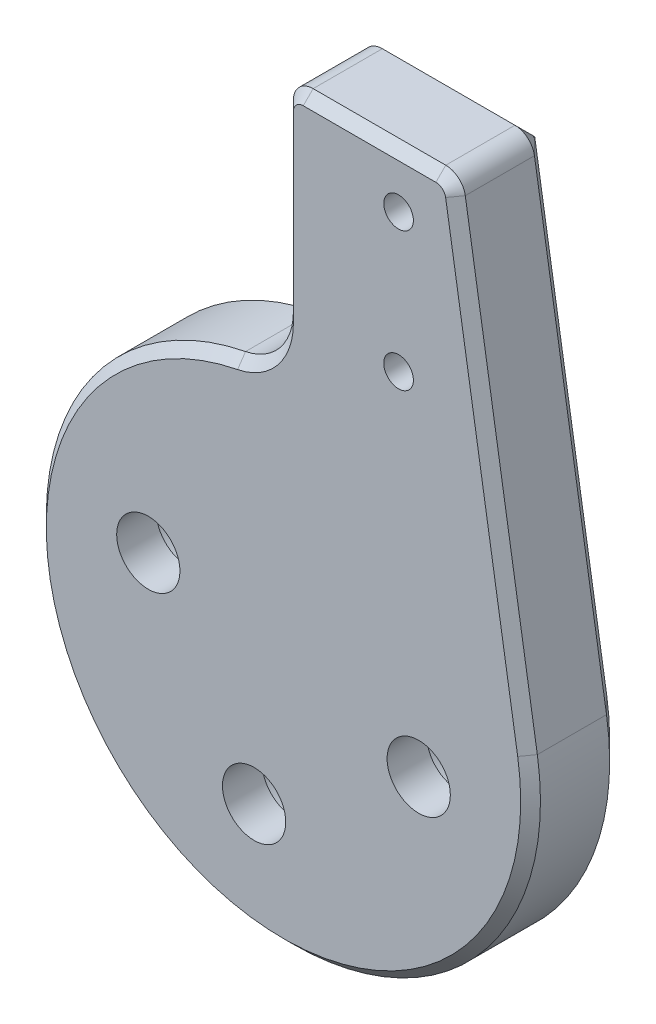
ISO-10303-21;
HEADER;
FILE_DESCRIPTION(('STEP AP214'),'2;1');
FILE_NAME('part.step','',(''),(''),'','','');
FILE_SCHEMA(('AUTOMOTIVE_DESIGN { 1 0 10303 214 1 1 1 1 }'));
ENDSEC;
DATA;
#1=APPLICATION_CONTEXT('core data for automotive mechanical design processes');
#2=APPLICATION_PROTOCOL_DEFINITION('international standard','automotive_design',2000,#1);
#3=PRODUCT_CONTEXT('',#1,'mechanical');
#4=PRODUCT('Part','Part','',(#3));
#5=PRODUCT_RELATED_PRODUCT_CATEGORY('part','',(#4));
#6=PRODUCT_DEFINITION_FORMATION('','',#4);
#7=PRODUCT_DEFINITION_CONTEXT('part definition',#1,'design');
#8=PRODUCT_DEFINITION('design','',#6,#7);
#9=PRODUCT_DEFINITION_SHAPE('','',#8);
#10=(LENGTH_UNIT() NAMED_UNIT(*) SI_UNIT(.MILLI.,.METRE.));
#11=(NAMED_UNIT(*) PLANE_ANGLE_UNIT() SI_UNIT($,.RADIAN.));
#12=(NAMED_UNIT(*) SI_UNIT($,.STERADIAN.) SOLID_ANGLE_UNIT());
#13=UNCERTAINTY_MEASURE_WITH_UNIT(LENGTH_MEASURE(1.E-05),#10,'distance_accuracy_value','');
#14=(GEOMETRIC_REPRESENTATION_CONTEXT(3) GLOBAL_UNCERTAINTY_ASSIGNED_CONTEXT((#13)) GLOBAL_UNIT_ASSIGNED_CONTEXT((#10,
#11,#12)) REPRESENTATION_CONTEXT('',''));
#15=CARTESIAN_POINT('',(0.,0.,0.));
#16=DIRECTION('',(0.,0.,1.));
#17=DIRECTION('',(1.,0.,0.));
#18=AXIS2_PLACEMENT_3D('',#15,#16,#17);
#19=CARTESIAN_POINT('',(-1.48749999993683,-6.8401274660351,5.));
#20=DIRECTION('',(0.,0.,-1.));
#21=DIRECTION('',(-1.,0.,0.));
#22=AXIS2_PLACEMENT_3D('',#19,#20,#21);
#23=CYLINDRICAL_SURFACE('',#22,1.6);
#24=CARTESIAN_POINT('',(-1.48749999993683,-6.8401274660351,-2.));
#25=DIRECTION('',(0.,0.,-1.));
#26=DIRECTION('',(-1.,0.,0.));
#27=AXIS2_PLACEMENT_3D('',#24,#25,#26);
#28=CIRCLE('',#27,1.6);
#29=CARTESIAN_POINT('',(-3.08749999993683,-6.8401274660351,-2.));
#30=VERTEX_POINT('',#29);
#31=EDGE_CURVE('E199',#30,#30,#28,.T.);
#32=ORIENTED_EDGE('',*,*,#31,.T.);
#33=EDGE_LOOP('',(#32));
#34=FACE_BOUND('',#33,.T.);
#35=CARTESIAN_POINT('',(-1.48749999993683,-6.8401274660351,0.));
#36=DIRECTION('',(0.,0.,1.));
#37=DIRECTION('',(1.,0.,0.));
#38=AXIS2_PLACEMENT_3D('',#35,#36,#37);
#39=CIRCLE('',#38,1.6);
#40=CARTESIAN_POINT('',(0.112500000063169,-6.8401274660351,0.));
#41=VERTEX_POINT('',#40);
#42=EDGE_CURVE('E235',#41,#41,#39,.T.);
#43=ORIENTED_EDGE('',*,*,#42,.T.);
#44=EDGE_LOOP('',(#43));
#45=FACE_BOUND('',#44,.T.);
#46=ADVANCED_FACE('F41',(#34,#45),#23,.F.);
#47=CARTESIAN_POINT('',(6.84012746598076,-1.48750000011751,5.));
#48=DIRECTION('',(0.,0.,-1.));
#49=DIRECTION('',(-1.,0.,0.));
#50=AXIS2_PLACEMENT_3D('',#47,#48,#49);
#51=CYLINDRICAL_SURFACE('',#50,1.6);
#52=CARTESIAN_POINT('',(6.84012746598076,-1.48750000011751,-2.));
#53=DIRECTION('',(0.,0.,-1.));
#54=DIRECTION('',(-1.,0.,0.));
#55=AXIS2_PLACEMENT_3D('',#52,#53,#54);
#56=CIRCLE('',#55,1.6);
#57=CARTESIAN_POINT('',(5.24012746598075,-1.48750000011751,-2.));
#58=VERTEX_POINT('',#57);
#59=EDGE_CURVE('E220',#58,#58,#56,.T.);
#60=ORIENTED_EDGE('',*,*,#59,.T.);
#61=EDGE_LOOP('',(#60));
#62=FACE_BOUND('',#61,.T.);
#63=CARTESIAN_POINT('',(6.84012746598076,-1.48750000011751,0.));
#64=DIRECTION('',(0.,0.,1.));
#65=DIRECTION('',(1.,0.,0.));
#66=AXIS2_PLACEMENT_3D('',#63,#64,#65);
#67=CIRCLE('',#66,1.6);
#68=CARTESIAN_POINT('',(8.44012746598076,-1.48750000011751,0.));
#69=VERTEX_POINT('',#68);
#70=EDGE_CURVE('E727',#69,#69,#67,.T.);
#71=ORIENTED_EDGE('',*,*,#70,.T.);
#72=EDGE_LOOP('',(#71));
#73=FACE_BOUND('',#72,.T.);
#74=ADVANCED_FACE('F372',(#62,#73),#51,.F.);
#75=CARTESIAN_POINT('',(-6.84012746585444,1.48749999988239,5.));
#76=DIRECTION('',(0.,0.,-1.));
#77=DIRECTION('',(-1.,0.,0.));
#78=AXIS2_PLACEMENT_3D('',#75,#76,#77);
#79=CYLINDRICAL_SURFACE('',#78,1.6);
#80=CARTESIAN_POINT('',(-6.84012746585444,1.48749999988239,-2.));
#81=DIRECTION('',(0.,0.,-1.));
#82=DIRECTION('',(-1.,0.,0.));
#83=AXIS2_PLACEMENT_3D('',#80,#81,#82);
#84=CIRCLE('',#83,1.6);
#85=CARTESIAN_POINT('',(-8.44012746585444,1.48749999988239,-2.));
#86=VERTEX_POINT('',#85);
#87=EDGE_CURVE('E217',#86,#86,#84,.T.);
#88=ORIENTED_EDGE('',*,*,#87,.T.);
#89=EDGE_LOOP('',(#88));
#90=FACE_BOUND('',#89,.T.);
#91=CARTESIAN_POINT('',(-6.84012746585444,1.48749999988239,0.));
#92=DIRECTION('',(0.,0.,1.));
#93=DIRECTION('',(1.,0.,0.));
#94=AXIS2_PLACEMENT_3D('',#91,#92,#93);
#95=CIRCLE('',#94,1.6);
#96=CARTESIAN_POINT('',(-5.24012746585444,1.48749999988239,0.));
#97=VERTEX_POINT('',#96);
#98=EDGE_CURVE('E731',#97,#97,#95,.T.);
#99=ORIENTED_EDGE('',*,*,#98,.T.);
#100=EDGE_LOOP('',(#99));
#101=FACE_BOUND('',#100,.T.);
#102=ADVANCED_FACE('F378',(#90,#101),#79,.F.);
#103=CARTESIAN_POINT('',(5.82086052217418,15.75,5.));
#104=DIRECTION('',(0.,0.,-1.));
#105=DIRECTION('',(-1.,0.,0.));
#106=AXIS2_PLACEMENT_3D('',#103,#104,#105);
#107=CYLINDRICAL_SURFACE('',#106,0.75);
#108=CARTESIAN_POINT('',(5.82086052217418,15.75,-5.));
#109=DIRECTION('',(0.,0.,1.));
#110=DIRECTION('',(1.,0.,0.));
#111=AXIS2_PLACEMENT_3D('',#108,#109,#110);
#112=CIRCLE('',#111,0.75);
#113=CARTESIAN_POINT('',(6.57086052217418,15.75,-5.));
#114=VERTEX_POINT('',#113);
#115=EDGE_CURVE('E270',#114,#114,#112,.T.);
#116=ORIENTED_EDGE('',*,*,#115,.F.);
#117=EDGE_LOOP('',(#116));
#118=FACE_BOUND('',#117,.T.);
#119=CARTESIAN_POINT('',(5.82086052217418,15.75,0.));
#120=DIRECTION('',(0.,0.,1.));
#121=DIRECTION('',(1.,0.,0.));
#122=AXIS2_PLACEMENT_3D('',#119,#120,#121);
#123=CIRCLE('',#122,0.75);
#124=CARTESIAN_POINT('',(6.57086052217418,15.75,0.));
#125=VERTEX_POINT('',#124);
#126=EDGE_CURVE('E735',#125,#125,#123,.T.);
#127=ORIENTED_EDGE('',*,*,#126,.T.);
#128=EDGE_LOOP('',(#127));
#129=FACE_BOUND('',#128,.T.);
#130=ADVANCED_FACE('F385',(#118,#129),#107,.F.);
#131=CARTESIAN_POINT('',(5.82086052217415,22.75,5.));
#132=DIRECTION('',(0.,0.,-1.));
#133=DIRECTION('',(-1.,0.,0.));
#134=AXIS2_PLACEMENT_3D('',#131,#132,#133);
#135=CYLINDRICAL_SURFACE('',#134,0.75);
#136=CARTESIAN_POINT('',(5.82086052217415,22.75,-5.));
#137=DIRECTION('',(0.,0.,1.));
#138=DIRECTION('',(1.,0.,0.));
#139=AXIS2_PLACEMENT_3D('',#136,#137,#138);
#140=CIRCLE('',#139,0.75);
#141=CARTESIAN_POINT('',(6.57086052217415,22.75,-5.));
#142=VERTEX_POINT('',#141);
#143=EDGE_CURVE('E216',#142,#142,#140,.T.);
#144=ORIENTED_EDGE('',*,*,#143,.F.);
#145=EDGE_LOOP('',(#144));
#146=FACE_BOUND('',#145,.T.);
#147=CARTESIAN_POINT('',(5.82086052217415,22.75,0.));
#148=DIRECTION('',(0.,0.,1.));
#149=DIRECTION('',(1.,0.,0.));
#150=AXIS2_PLACEMENT_3D('',#147,#148,#149);
#151=CIRCLE('',#150,0.75);
#152=CARTESIAN_POINT('',(6.57086052217415,22.75,0.));
#153=VERTEX_POINT('',#152);
#154=EDGE_CURVE('E738',#153,#153,#151,.T.);
#155=ORIENTED_EDGE('',*,*,#154,.T.);
#156=EDGE_LOOP('',(#155));
#157=FACE_BOUND('',#156,.T.);
#158=ADVANCED_FACE('F388',(#146,#157),#135,.F.);
#159=CARTESIAN_POINT('',(-3.,15.2069063256196,-5.));
#160=DIRECTION('',(0.,0.,1.));
#161=DIRECTION('',(1.,0.,0.));
#162=AXIS2_PLACEMENT_3D('',#159,#160,#161);
#163=CYLINDRICAL_SURFACE('',#162,3.);
#164=DIRECTION('',(0.,0.,1.));
#165=VECTOR('',#164,1.);
#166=CARTESIAN_POINT('',(-2.41935483870505,12.2636341335408,-5.));
#167=LINE('',#166,#165);
#168=CARTESIAN_POINT('',(-2.41935483870505,12.2636341335408,-4.00000000000001));
#169=VERTEX_POINT('',#168);
#170=CARTESIAN_POINT('',(-2.41935483870505,12.2636341335408,-0.5));
#171=VERTEX_POINT('',#170);
#172=EDGE_CURVE('E273',#169,#171,#167,.T.);
#173=ORIENTED_EDGE('',*,*,#172,.T.);
#174=CARTESIAN_POINT('',(-3.,15.2069063256196,-0.5));
#175=DIRECTION('',(0.,0.,-1.));
#176=DIRECTION('',(-1.,0.,0.));
#177=AXIS2_PLACEMENT_3D('',#174,#175,#176);
#178=CIRCLE('',#177,3.);
#179=CARTESIAN_POINT('',(0.,15.2069063256196,-0.5));
#180=VERTEX_POINT('',#179);
#181=EDGE_CURVE('E156',#171,#180,#178,.F.);
#182=ORIENTED_EDGE('',*,*,#181,.T.);
#183=DIRECTION('',(0.,0.,1.));
#184=VECTOR('',#183,1.);
#185=CARTESIAN_POINT('',(0.,15.2069063256196,-5.));
#186=LINE('',#185,#184);
#187=CARTESIAN_POINT('',(0.,15.2069063256196,-4.00000000000001));
#188=VERTEX_POINT('',#187);
#189=EDGE_CURVE('E288',#188,#180,#186,.T.);
#190=ORIENTED_EDGE('',*,*,#189,.F.);
#191=CARTESIAN_POINT('',(-3.,15.2069063256196,-4.00000000000001));
#192=DIRECTION('',(0.,0.,-1.));
#193=DIRECTION('',(-1.,0.,0.));
#194=AXIS2_PLACEMENT_3D('',#191,#192,#193);
#195=CIRCLE('',#194,3.);
#196=EDGE_CURVE('E181',#188,#169,#195,.T.);
#197=ORIENTED_EDGE('',*,*,#196,.T.);
#198=EDGE_LOOP('',(#173,#182,#190,#197));
#199=FACE_BOUND('',#198,.T.);
#200=ADVANCED_FACE('F313',(#199),#163,.F.);
#201=CARTESIAN_POINT('',(0.,0.,-5.));
#202=DIRECTION('',(-1.,0.,0.));
#203=DIRECTION('',(0.,-1.,0.));
#204=AXIS2_PLACEMENT_3D('',#201,#202,#203);
#205=PLANE('',#204);
#206=ORIENTED_EDGE('',*,*,#189,.T.);
#207=DIRECTION('',(0.,1.,0.));
#208=VECTOR('',#207,1.);
#209=CARTESIAN_POINT('',(0.,24.4916028712934,-0.5));
#210=LINE('',#209,#208);
#211=CARTESIAN_POINT('',(0.,24.4916028712934,-0.5));
#212=VERTEX_POINT('',#211);
#213=EDGE_CURVE('E229',#180,#212,#210,.T.);
#214=ORIENTED_EDGE('',*,*,#213,.T.);
#215=DIRECTION('',(0.,0.,1.));
#216=VECTOR('',#215,1.);
#217=CARTESIAN_POINT('',(0.,24.4916028712934,-5.));
#218=LINE('',#217,#216);
#219=CARTESIAN_POINT('',(0.,24.4916028712934,-4.00000000000001));
#220=VERTEX_POINT('',#219);
#221=EDGE_CURVE('E286',#220,#212,#218,.T.);
#222=ORIENTED_EDGE('',*,*,#221,.F.);
#223=DIRECTION('',(0.,-1.,0.));
#224=VECTOR('',#223,1.);
#225=CARTESIAN_POINT('',(0.,0.,-4.00000000000001));
#226=LINE('',#225,#224);
#227=EDGE_CURVE('E186',#220,#188,#226,.T.);
#228=ORIENTED_EDGE('',*,*,#227,.T.);
#229=EDGE_LOOP('',(#206,#214,#222,#228));
#230=FACE_BOUND('',#229,.T.);
#231=ADVANCED_FACE('F316',(#230),#205,.T.);
#232=CARTESIAN_POINT('',(1.,24.4916028712934,-5.));
#233=DIRECTION('',(0.,0.,1.));
#234=DIRECTION('',(1.,0.,0.));
#235=AXIS2_PLACEMENT_3D('',#232,#233,#234);
#236=CYLINDRICAL_SURFACE('',#235,1.);
#237=ORIENTED_EDGE('',*,*,#221,.T.);
#238=CARTESIAN_POINT('',(1.,24.4916028712934,-0.5));
#239=DIRECTION('',(0.,0.,-1.));
#240=DIRECTION('',(-1.,0.,0.));
#241=AXIS2_PLACEMENT_3D('',#238,#239,#240);
#242=CIRCLE('',#241,1.);
#243=CARTESIAN_POINT('',(1.00000000000001,25.4916028712934,-0.5));
#244=VERTEX_POINT('',#243);
#245=EDGE_CURVE('E65',#212,#244,#242,.T.);
#246=ORIENTED_EDGE('',*,*,#245,.T.);
#247=DIRECTION('',(0.,0.,1.));
#248=VECTOR('',#247,1.);
#249=CARTESIAN_POINT('',(1.00000000000001,25.4916028712934,-5.));
#250=LINE('',#249,#248);
#251=CARTESIAN_POINT('',(1.00000000000001,25.4916028712934,-4.00000000000001));
#252=VERTEX_POINT('',#251);
#253=EDGE_CURVE('E284',#252,#244,#250,.T.);
#254=ORIENTED_EDGE('',*,*,#253,.F.);
#255=CARTESIAN_POINT('',(1.,24.4916028712934,-4.00000000000001));
#256=DIRECTION('',(0.,0.,-1.));
#257=DIRECTION('',(-1.,0.,0.));
#258=AXIS2_PLACEMENT_3D('',#255,#256,#257);
#259=CIRCLE('',#258,1.);
#260=EDGE_CURVE('E190',#252,#220,#259,.F.);
#261=ORIENTED_EDGE('',*,*,#260,.T.);
#262=EDGE_LOOP('',(#237,#246,#254,#261));
#263=FACE_BOUND('',#262,.T.);
#264=ADVANCED_FACE('F358',(#263),#236,.T.);
#265=CARTESIAN_POINT('',(0.,25.4916028712934,-5.));
#266=DIRECTION('',(0.,-1.,0.));
#267=DIRECTION('',(0.,0.,-1.));
#268=AXIS2_PLACEMENT_3D('',#265,#266,#267);
#269=PLANE('',#268);
#270=ORIENTED_EDGE('',*,*,#253,.T.);
#271=DIRECTION('',(1.,0.,0.));
#272=VECTOR('',#271,1.);
#273=CARTESIAN_POINT('',(0.,25.4916028712934,-0.5));
#274=LINE('',#273,#272);
#275=CARTESIAN_POINT('',(7.70860857188569,25.4916028712934,-0.5));
#276=VERTEX_POINT('',#275);
#277=EDGE_CURVE('E11',#244,#276,#274,.T.);
#278=ORIENTED_EDGE('',*,*,#277,.T.);
#279=DIRECTION('',(0.,0.,1.));
#280=VECTOR('',#279,1.);
#281=CARTESIAN_POINT('',(7.70860857188569,25.4916028712934,-5.));
#282=LINE('',#281,#280);
#283=CARTESIAN_POINT('',(7.70860857188569,25.4916028712934,-4.00000000000001));
#284=VERTEX_POINT('',#283);
#285=EDGE_CURVE('E282',#284,#276,#282,.T.);
#286=ORIENTED_EDGE('',*,*,#285,.F.);
#287=DIRECTION('',(-1.,0.,0.));
#288=VECTOR('',#287,1.);
#289=CARTESIAN_POINT('',(1.00000000000001,25.4916028712934,-4.00000000000001));
#290=LINE('',#289,#288);
#291=EDGE_CURVE('E194',#284,#252,#290,.T.);
#292=ORIENTED_EDGE('',*,*,#291,.T.);
#293=EDGE_LOOP('',(#270,#278,#286,#292));
#294=FACE_BOUND('',#293,.T.);
#295=ADVANCED_FACE('F357',(#294),#269,.F.);
#296=CARTESIAN_POINT('',(7.7086085718857,24.4916028712934,-5.));
#297=DIRECTION('',(0.,0.,1.));
#298=DIRECTION('',(1.,0.,0.));
#299=AXIS2_PLACEMENT_3D('',#296,#297,#298);
#300=CYLINDRICAL_SURFACE('',#299,1.);
#301=ORIENTED_EDGE('',*,*,#285,.T.);
#302=CARTESIAN_POINT('',(7.7086085718857,24.4916028712934,-0.5));
#303=DIRECTION('',(0.,0.,-1.));
#304=DIRECTION('',(-1.,0.,0.));
#305=AXIS2_PLACEMENT_3D('',#302,#303,#304);
#306=CIRCLE('',#305,1.);
#307=CARTESIAN_POINT('',(8.69591975046541,24.6504003418386,-0.5));
#308=VERTEX_POINT('',#307);
#309=EDGE_CURVE('E51',#276,#308,#306,.T.);
#310=ORIENTED_EDGE('',*,*,#309,.T.);
#311=DIRECTION('',(0.,0.,1.));
#312=VECTOR('',#311,1.);
#313=CARTESIAN_POINT('',(8.69591975046541,24.6504003418386,-5.));
#314=LINE('',#313,#312);
#315=CARTESIAN_POINT('',(8.69591975046541,24.6504003418386,-4.00000000000001));
#316=VERTEX_POINT('',#315);
#317=EDGE_CURVE('E279',#316,#308,#314,.T.);
#318=ORIENTED_EDGE('',*,*,#317,.F.);
#319=CARTESIAN_POINT('',(7.7086085718857,24.4916028712934,-4.00000000000001));
#320=DIRECTION('',(0.,0.,-1.));
#321=DIRECTION('',(-1.,0.,0.));
#322=AXIS2_PLACEMENT_3D('',#319,#320,#321);
#323=CIRCLE('',#322,1.);
#324=EDGE_CURVE('E192',#316,#284,#323,.F.);
#325=ORIENTED_EDGE('',*,*,#324,.T.);
#326=EDGE_LOOP('',(#301,#310,#318,#325));
#327=FACE_BOUND('',#326,.T.);
#328=ADVANCED_FACE('F356',(#327),#300,.T.);
#329=CARTESIAN_POINT('',(12.3413897321244,1.98496838179509,-5.));
#330=DIRECTION('',(-0.987311178579709,-0.158797470545176,0.));
#331=DIRECTION('',(0.158797470545176,-0.987311178579709,0.));
#332=AXIS2_PLACEMENT_3D('',#329,#330,#331);
#333=PLANE('',#332);
#334=ORIENTED_EDGE('',*,*,#317,.T.);
#335=DIRECTION('',(0.158797470545176,-0.987311178579709,0.));
#336=VECTOR('',#335,1.);
#337=CARTESIAN_POINT('',(12.3413897321244,1.98496838179509,-0.5));
#338=LINE('',#337,#336);
#339=CARTESIAN_POINT('',(12.3413897321244,1.98496838179509,-0.5));
#340=VERTEX_POINT('',#339);
#341=EDGE_CURVE('E231',#308,#340,#338,.T.);
#342=ORIENTED_EDGE('',*,*,#341,.T.);
#343=DIRECTION('',(0.,0.,1.));
#344=VECTOR('',#343,1.);
#345=CARTESIAN_POINT('',(12.3413897321244,1.98496838179509,-5.));
#346=LINE('',#345,#344);
#347=CARTESIAN_POINT('',(12.3413897321244,1.98496838179509,-4.00000000000001));
#348=VERTEX_POINT('',#347);
#349=EDGE_CURVE('E276',#348,#340,#346,.T.);
#350=ORIENTED_EDGE('',*,*,#349,.F.);
#351=DIRECTION('',(-0.158797470545176,0.987311178579709,0.));
#352=VECTOR('',#351,1.);
#353=CARTESIAN_POINT('',(8.69591975046541,24.6504003418386,-4.00000000000001));
#354=LINE('',#353,#352);
#355=EDGE_CURVE('E188',#348,#316,#354,.T.);
#356=ORIENTED_EDGE('',*,*,#355,.T.);
#357=EDGE_LOOP('',(#334,#342,#350,#356));
#358=FACE_BOUND('',#357,.T.);
#359=ADVANCED_FACE('F333',(#358),#333,.F.);
#360=CARTESIAN_POINT('',(0.,0.,-5.));
#361=DIRECTION('',(0.,0.,1.));
#362=DIRECTION('',(1.,0.,0.));
#363=AXIS2_PLACEMENT_3D('',#360,#361,#362);
#364=CYLINDRICAL_SURFACE('',#363,12.4999999998765);
#365=ORIENTED_EDGE('',*,*,#349,.T.);
#366=CARTESIAN_POINT('',(0.,0.,-0.5));
#367=DIRECTION('',(0.,0.,-1.));
#368=DIRECTION('',(-1.,0.,0.));
#369=AXIS2_PLACEMENT_3D('',#366,#367,#368);
#370=CIRCLE('',#369,12.4999999998765);
#371=EDGE_CURVE('E227',#340,#171,#370,.T.);
#372=ORIENTED_EDGE('',*,*,#371,.T.);
#373=ORIENTED_EDGE('',*,*,#172,.F.);
#374=CARTESIAN_POINT('',(0.,0.,-4.00000000000001));
#375=DIRECTION('',(0.,0.,-1.));
#376=DIRECTION('',(-1.,0.,0.));
#377=AXIS2_PLACEMENT_3D('',#374,#375,#376);
#378=CIRCLE('',#377,12.4999999998765);
#379=EDGE_CURVE('E184',#169,#348,#378,.F.);
#380=ORIENTED_EDGE('',*,*,#379,.T.);
#381=EDGE_LOOP('',(#365,#372,#373,#380));
#382=FACE_BOUND('',#381,.T.);
#383=ADVANCED_FACE('F329',(#382),#364,.T.);
#384=CARTESIAN_POINT('',(0.,0.,-5.));
#385=DIRECTION('',(0.,0.,-1.));
#386=DIRECTION('',(1.,0.,0.));
#387=AXIS2_PLACEMENT_3D('',#384,#385,#386);
#388=PLANE('',#387);
#389=CARTESIAN_POINT('',(6.84012746598076,-1.48750000011751,-5.));
#390=DIRECTION('',(0.,0.,1.));
#391=DIRECTION('',(1.,0.,0.));
#392=AXIS2_PLACEMENT_3D('',#389,#390,#391);
#393=CIRCLE('',#392,2.8);
#394=CARTESIAN_POINT('',(9.64012746598076,-1.48750000011751,-5.));
#395=VERTEX_POINT('',#394);
#396=EDGE_CURVE('E248',#395,#395,#393,.T.);
#397=ORIENTED_EDGE('',*,*,#396,.T.);
#398=EDGE_LOOP('',(#397));
#399=FACE_BOUND('',#398,.T.);
#400=CARTESIAN_POINT('',(-1.48749999993683,-6.8401274660351,-5.));
#401=DIRECTION('',(0.,0.,1.));
#402=DIRECTION('',(1.,0.,0.));
#403=AXIS2_PLACEMENT_3D('',#400,#401,#402);
#404=CIRCLE('',#403,2.8);
#405=CARTESIAN_POINT('',(1.31250000006317,-6.8401274660351,-5.));
#406=VERTEX_POINT('',#405);
#407=EDGE_CURVE('E258',#406,#406,#404,.T.);
#408=ORIENTED_EDGE('',*,*,#407,.T.);
#409=EDGE_LOOP('',(#408));
#410=FACE_BOUND('',#409,.T.);
#411=CARTESIAN_POINT('',(-6.84012746585444,1.48749999988239,-5.));
#412=DIRECTION('',(0.,0.,1.));
#413=DIRECTION('',(1.,0.,0.));
#414=AXIS2_PLACEMENT_3D('',#411,#412,#413);
#415=CIRCLE('',#414,2.8);
#416=CARTESIAN_POINT('',(-4.04012746585444,1.48749999988239,-5.));
#417=VERTEX_POINT('',#416);
#418=EDGE_CURVE('E264',#417,#417,#415,.T.);
#419=ORIENTED_EDGE('',*,*,#418,.T.);
#420=EDGE_LOOP('',(#419));
#421=FACE_BOUND('',#420,.T.);
#422=CARTESIAN_POINT('',(0.,0.,-5.));
#423=DIRECTION('',(0.,0.,-1.));
#424=DIRECTION('',(-1.,0.,0.));
#425=AXIS2_PLACEMENT_3D('',#422,#423,#424);
#426=CIRCLE('',#425,11.4999999998765);
#427=CARTESIAN_POINT('',(11.3540785535447,1.82617091124991,-5.));
#428=VERTEX_POINT('',#427);
#429=CARTESIAN_POINT('',(-2.22580645160673,11.2825434028478,-5.));
#430=VERTEX_POINT('',#429);
#431=EDGE_CURVE('E176',#428,#430,#426,.T.);
#432=ORIENTED_EDGE('',*,*,#431,.T.);
#433=CARTESIAN_POINT('',(-3.,15.2069063256196,-5.));
#434=DIRECTION('',(0.,0.,-1.));
#435=DIRECTION('',(-1.,0.,0.));
#436=AXIS2_PLACEMENT_3D('',#433,#434,#435);
#437=CIRCLE('',#436,3.99999999999999);
#438=CARTESIAN_POINT('',(0.999999999999994,15.2069063256196,-5.));
#439=VERTEX_POINT('',#438);
#440=EDGE_CURVE('E178',#430,#439,#437,.F.);
#441=ORIENTED_EDGE('',*,*,#440,.T.);
#442=DIRECTION('',(0.,1.,0.));
#443=VECTOR('',#442,1.);
#444=CARTESIAN_POINT('',(0.999999999999994,0.,-5.));
#445=LINE('',#444,#443);
#446=CARTESIAN_POINT('',(1.,24.4916028712934,-5.));
#447=VERTEX_POINT('',#446);
#448=EDGE_CURVE('E174',#439,#447,#445,.T.);
#449=ORIENTED_EDGE('',*,*,#448,.T.);
#450=DIRECTION('',(1.,0.,0.));
#451=VECTOR('',#450,1.);
#452=CARTESIAN_POINT('',(7.70860857188569,24.4916028712934,-5.));
#453=LINE('',#452,#451);
#454=CARTESIAN_POINT('',(7.7086085718857,24.4916028712934,-5.));
#455=VERTEX_POINT('',#454);
#456=EDGE_CURVE('E149',#447,#455,#453,.T.);
#457=ORIENTED_EDGE('',*,*,#456,.T.);
#458=DIRECTION('',(0.158797470545176,-0.987311178579709,0.));
#459=VECTOR('',#458,1.);
#460=CARTESIAN_POINT('',(11.3540785535447,1.82617091124991,-5.));
#461=LINE('',#460,#459);
#462=EDGE_CURVE('E172',#455,#428,#461,.T.);
#463=ORIENTED_EDGE('',*,*,#462,.T.);
#464=EDGE_LOOP('',(#432,#441,#449,#457,#463));
#465=FACE_BOUND('',#464,.T.);
#466=ORIENTED_EDGE('',*,*,#143,.T.);
#467=EDGE_LOOP('',(#466));
#468=FACE_BOUND('',#467,.T.);
#469=ORIENTED_EDGE('',*,*,#115,.T.);
#470=EDGE_LOOP('',(#469));
#471=FACE_BOUND('',#470,.T.);
#472=ADVANCED_FACE('F344',(#399,#410,#421,#465,#468,#471),#388,.T.);
#473=CARTESIAN_POINT('',(7.7086085718857,24.4916028712934,-4.00000000000001));
#474=DIRECTION('',(0.,0.,1.));
#475=DIRECTION('',(1.,0.,0.));
#476=AXIS2_PLACEMENT_3D('',#473,#474,#475);
#477=CONICAL_SURFACE('',#476,0.999999999999994,0.785398163397448);
#478=DIRECTION('',(0.698134429514994,0.112286768257765,0.707106781186548));
#479=VECTOR('',#478,1.);
#480=CARTESIAN_POINT('',(7.70860857188571,24.4916028712934,-5.));
#481=LINE('',#480,#479);
#482=EDGE_CURVE('E210',#455,#316,#481,.T.);
#483=ORIENTED_EDGE('',*,*,#482,.F.);
#484=DIRECTION('',(0.,-0.707106781186547,-0.707106781186547));
#485=VECTOR('',#484,1.);
#486=CARTESIAN_POINT('',(7.70860857188569,25.4916028712934,-4.00000000000001));
#487=LINE('',#486,#485);
#488=EDGE_CURVE('E213',#284,#455,#487,.T.);
#489=ORIENTED_EDGE('',*,*,#488,.F.);
#490=ORIENTED_EDGE('',*,*,#324,.F.);
#491=EDGE_LOOP('',(#483,#489,#490));
#492=FACE_BOUND('',#491,.T.);
#493=ADVANCED_FACE('F354',(#492),#477,.T.);
#494=CARTESIAN_POINT('',(0.,24.4916028712934,-5.));
#495=DIRECTION('',(0.,0.707106781186547,-0.707106781186547));
#496=DIRECTION('',(-1.,0.,0.));
#497=AXIS2_PLACEMENT_3D('',#494,#495,#496);
#498=PLANE('',#497);
#499=ORIENTED_EDGE('',*,*,#488,.T.);
#500=ORIENTED_EDGE('',*,*,#456,.F.);
#501=DIRECTION('',(0.,-0.707106781186547,-0.707106781186547));
#502=VECTOR('',#501,1.);
#503=CARTESIAN_POINT('',(1.00000000000001,25.4916028712934,-4.00000000000001));
#504=LINE('',#503,#502);
#505=EDGE_CURVE('E207',#252,#447,#504,.T.);
#506=ORIENTED_EDGE('',*,*,#505,.F.);
#507=ORIENTED_EDGE('',*,*,#291,.F.);
#508=EDGE_LOOP('',(#499,#500,#506,#507));
#509=FACE_BOUND('',#508,.T.);
#510=ADVANCED_FACE('F351',(#509),#498,.T.);
#511=CARTESIAN_POINT('',(11.3540785535447,1.82617091124991,-5.));
#512=DIRECTION('',(0.698134429514995,0.112286768257765,-0.707106781186547));
#513=DIRECTION('',(-0.158797470545176,0.987311178579709,0.));
#514=AXIS2_PLACEMENT_3D('',#511,#512,#513);
#515=PLANE('',#514);
#516=ORIENTED_EDGE('',*,*,#482,.T.);
#517=ORIENTED_EDGE('',*,*,#355,.F.);
#518=DIRECTION('',(0.698134429514994,0.112286768257765,0.707106781186548));
#519=VECTOR('',#518,1.);
#520=CARTESIAN_POINT('',(11.3540785535447,1.82617091124991,-5.));
#521=LINE('',#520,#519);
#522=EDGE_CURVE('E204',#428,#348,#521,.T.);
#523=ORIENTED_EDGE('',*,*,#522,.F.);
#524=ORIENTED_EDGE('',*,*,#462,.F.);
#525=EDGE_LOOP('',(#516,#517,#523,#524));
#526=FACE_BOUND('',#525,.T.);
#527=ADVANCED_FACE('F337',(#526),#515,.T.);
#528=CARTESIAN_POINT('',(1.,24.4916028712934,-4.00000000000001));
#529=DIRECTION('',(0.,0.,1.));
#530=DIRECTION('',(1.,0.,0.));
#531=AXIS2_PLACEMENT_3D('',#528,#529,#530);
#532=CONICAL_SURFACE('',#531,0.999999999999994,0.785398163397448);
#533=ORIENTED_EDGE('',*,*,#260,.F.);
#534=ORIENTED_EDGE('',*,*,#505,.T.);
#535=DIRECTION('',(0.707106781186548,0.,-0.707106781186547));
#536=VECTOR('',#535,1.);
#537=CARTESIAN_POINT('',(0.,24.4916028712934,-4.00000000000001));
#538=LINE('',#537,#536);
#539=EDGE_CURVE('E201',#220,#447,#538,.T.);
#540=ORIENTED_EDGE('',*,*,#539,.F.);
#541=EDGE_LOOP('',(#533,#534,#540));
#542=FACE_BOUND('',#541,.T.);
#543=ADVANCED_FACE('F361',(#542),#532,.T.);
#544=CARTESIAN_POINT('',(0.,0.,-4.00000000000001));
#545=DIRECTION('',(0.,0.,1.));
#546=DIRECTION('',(1.,0.,0.));
#547=AXIS2_PLACEMENT_3D('',#544,#545,#546);
#548=CONICAL_SURFACE('',#547,12.4999999998765,0.785398163397448);
#549=ORIENTED_EDGE('',*,*,#522,.T.);
#550=ORIENTED_EDGE('',*,*,#379,.F.);
#551=DIRECTION('',(-0.136859377004939,0.693735908632255,0.707106781186547));
#552=VECTOR('',#551,1.);
#553=CARTESIAN_POINT('',(-2.22580645160673,11.2825434028478,-5.));
#554=LINE('',#553,#552);
#555=EDGE_CURVE('E198',#430,#169,#554,.T.);
#556=ORIENTED_EDGE('',*,*,#555,.F.);
#557=ORIENTED_EDGE('',*,*,#431,.F.);
#558=EDGE_LOOP('',(#549,#550,#556,#557));
#559=FACE_BOUND('',#558,.T.);
#560=ADVANCED_FACE('F342',(#559),#548,.T.);
#561=CARTESIAN_POINT('',(0.,0.,-4.00000000000001));
#562=DIRECTION('',(0.707106781186547,0.,0.707106781186547));
#563=DIRECTION('',(0.,-1.,0.));
#564=AXIS2_PLACEMENT_3D('',#561,#562,#563);
#565=PLANE('',#564);
#566=ORIENTED_EDGE('',*,*,#539,.T.);
#567=ORIENTED_EDGE('',*,*,#448,.F.);
#568=DIRECTION('',(0.707106781186547,0.,-0.707106781186547));
#569=VECTOR('',#568,1.);
#570=CARTESIAN_POINT('',(0.,15.2069063256196,-4.00000000000001));
#571=LINE('',#570,#569);
#572=EDGE_CURVE('E196',#188,#439,#571,.T.);
#573=ORIENTED_EDGE('',*,*,#572,.F.);
#574=ORIENTED_EDGE('',*,*,#227,.F.);
#575=EDGE_LOOP('',(#566,#567,#573,#574));
#576=FACE_BOUND('',#575,.T.);
#577=ADVANCED_FACE('F321',(#576),#565,.F.);
#578=CARTESIAN_POINT('',(-3.,15.2069063256196,-5.));
#579=DIRECTION('',(0.,0.,-1.));
#580=DIRECTION('',(-1.,0.,0.));
#581=AXIS2_PLACEMENT_3D('',#578,#579,#580);
#582=CONICAL_SURFACE('',#581,3.99999999999999,0.785398163397448);
#583=ORIENTED_EDGE('',*,*,#555,.T.);
#584=ORIENTED_EDGE('',*,*,#196,.F.);
#585=ORIENTED_EDGE('',*,*,#572,.T.);
#586=ORIENTED_EDGE('',*,*,#440,.F.);
#587=EDGE_LOOP('',(#583,#584,#585,#586));
#588=FACE_BOUND('',#587,.T.);
#589=ADVANCED_FACE('F325',(#588),#582,.F.);
#590=CARTESIAN_POINT('',(-6.84012746585444,1.48749999988239,-2.));
#591=DIRECTION('',(0.,0.,-1.));
#592=DIRECTION('',(-1.,0.,0.));
#593=AXIS2_PLACEMENT_3D('',#590,#591,#592);
#594=CYLINDRICAL_SURFACE('',#593,2.8);
#595=CARTESIAN_POINT('',(-6.84012746585444,1.48749999988239,-2.));
#596=DIRECTION('',(0.,0.,1.));
#597=DIRECTION('',(1.,0.,0.));
#598=AXIS2_PLACEMENT_3D('',#595,#596,#597);
#599=CIRCLE('',#598,2.8);
#600=CARTESIAN_POINT('',(-4.04012746585444,1.48749999988239,-2.));
#601=VERTEX_POINT('',#600);
#602=EDGE_CURVE('E221',#601,#601,#599,.T.);
#603=ORIENTED_EDGE('',*,*,#602,.T.);
#604=EDGE_LOOP('',(#603));
#605=FACE_BOUND('',#604,.T.);
#606=ORIENTED_EDGE('',*,*,#418,.F.);
#607=EDGE_LOOP('',(#606));
#608=FACE_BOUND('',#607,.T.);
#609=ADVANCED_FACE('F399',(#605,#608),#594,.F.);
#610=CARTESIAN_POINT('',(-6.84012746585444,1.48749999988239,-2.));
#611=DIRECTION('',(0.,0.,-1.));
#612=DIRECTION('',(1.,0.,0.));
#613=AXIS2_PLACEMENT_3D('',#610,#611,#612);
#614=PLANE('',#613);
#615=ORIENTED_EDGE('',*,*,#87,.F.);
#616=EDGE_LOOP('',(#615));
#617=FACE_BOUND('',#616,.T.);
#618=ORIENTED_EDGE('',*,*,#602,.F.);
#619=EDGE_LOOP('',(#618));
#620=FACE_BOUND('',#619,.T.);
#621=ADVANCED_FACE('F471',(#617,#620),#614,.T.);
#622=CARTESIAN_POINT('',(-1.48749999993683,-6.8401274660351,-2.));
#623=DIRECTION('',(0.,0.,-1.));
#624=DIRECTION('',(-1.,0.,0.));
#625=AXIS2_PLACEMENT_3D('',#622,#623,#624);
#626=CYLINDRICAL_SURFACE('',#625,2.8);
#627=CARTESIAN_POINT('',(-1.48749999993683,-6.8401274660351,-2.));
#628=DIRECTION('',(0.,0.,1.));
#629=DIRECTION('',(1.,0.,0.));
#630=AXIS2_PLACEMENT_3D('',#627,#628,#629);
#631=CIRCLE('',#630,2.8);
#632=CARTESIAN_POINT('',(1.31250000006317,-6.8401274660351,-2.));
#633=VERTEX_POINT('',#632);
#634=EDGE_CURVE('E267',#633,#633,#631,.T.);
#635=ORIENTED_EDGE('',*,*,#634,.T.);
#636=EDGE_LOOP('',(#635));
#637=FACE_BOUND('',#636,.T.);
#638=ORIENTED_EDGE('',*,*,#407,.F.);
#639=EDGE_LOOP('',(#638));
#640=FACE_BOUND('',#639,.T.);
#641=ADVANCED_FACE('F468',(#637,#640),#626,.F.);
#642=CARTESIAN_POINT('',(-1.48749999993683,-6.8401274660351,-2.));
#643=DIRECTION('',(0.,0.,-1.));
#644=DIRECTION('',(1.,0.,0.));
#645=AXIS2_PLACEMENT_3D('',#642,#643,#644);
#646=PLANE('',#645);
#647=ORIENTED_EDGE('',*,*,#31,.F.);
#648=EDGE_LOOP('',(#647));
#649=FACE_BOUND('',#648,.T.);
#650=ORIENTED_EDGE('',*,*,#634,.F.);
#651=EDGE_LOOP('',(#650));
#652=FACE_BOUND('',#651,.T.);
#653=ADVANCED_FACE('F462',(#649,#652),#646,.T.);
#654=CARTESIAN_POINT('',(6.84012746598076,-1.48750000011751,-2.));
#655=DIRECTION('',(0.,0.,-1.));
#656=DIRECTION('',(-1.,0.,0.));
#657=AXIS2_PLACEMENT_3D('',#654,#655,#656);
#658=CYLINDRICAL_SURFACE('',#657,2.8);
#659=CARTESIAN_POINT('',(6.84012746598076,-1.48750000011751,-2.));
#660=DIRECTION('',(0.,0.,1.));
#661=DIRECTION('',(1.,0.,0.));
#662=AXIS2_PLACEMENT_3D('',#659,#660,#661);
#663=CIRCLE('',#662,2.8);
#664=CARTESIAN_POINT('',(9.64012746598076,-1.48750000011751,-2.));
#665=VERTEX_POINT('',#664);
#666=EDGE_CURVE('E253',#665,#665,#663,.T.);
#667=ORIENTED_EDGE('',*,*,#666,.T.);
#668=EDGE_LOOP('',(#667));
#669=FACE_BOUND('',#668,.T.);
#670=ORIENTED_EDGE('',*,*,#396,.F.);
#671=EDGE_LOOP('',(#670));
#672=FACE_BOUND('',#671,.T.);
#673=ADVANCED_FACE('F456',(#669,#672),#658,.F.);
#674=CARTESIAN_POINT('',(6.84012746598076,-1.48750000011751,-2.));
#675=DIRECTION('',(0.,0.,-1.));
#676=DIRECTION('',(1.,0.,0.));
#677=AXIS2_PLACEMENT_3D('',#674,#675,#676);
#678=PLANE('',#677);
#679=ORIENTED_EDGE('',*,*,#59,.F.);
#680=EDGE_LOOP('',(#679));
#681=FACE_BOUND('',#680,.T.);
#682=ORIENTED_EDGE('',*,*,#666,.F.);
#683=EDGE_LOOP('',(#682));
#684=FACE_BOUND('',#683,.T.);
#685=ADVANCED_FACE('F452',(#681,#684),#678,.T.);
#686=CARTESIAN_POINT('',(7.7086085718857,24.4916028712934,-0.5));
#687=DIRECTION('',(0.,0.,-1.));
#688=DIRECTION('',(-1.,0.,0.));
#689=AXIS2_PLACEMENT_3D('',#686,#687,#688);
#690=CONICAL_SURFACE('',#689,1.,0.785398163397441);
#691=DIRECTION('',(-0.69813442951499,-0.112286768257764,0.707106781186552));
#692=VECTOR('',#691,1.);
#693=CARTESIAN_POINT('',(8.69591975046541,24.6504003418386,-0.5));
#694=LINE('',#693,#692);
#695=CARTESIAN_POINT('',(8.20226416117555,24.571001606566,0.));
#696=VERTEX_POINT('',#695);
#697=EDGE_CURVE('E242',#308,#696,#694,.T.);
#698=ORIENTED_EDGE('',*,*,#697,.F.);
#699=ORIENTED_EDGE('',*,*,#309,.F.);
#700=DIRECTION('',(0.,0.707106781186543,-0.707106781186552));
#701=VECTOR('',#700,1.);
#702=CARTESIAN_POINT('',(7.70860857188569,24.9916028712934,0.));
#703=LINE('',#702,#701);
#704=CARTESIAN_POINT('',(7.70860857188569,24.9916028712934,0.));
#705=VERTEX_POINT('',#704);
#706=EDGE_CURVE('E46',#705,#276,#703,.T.);
#707=ORIENTED_EDGE('',*,*,#706,.F.);
#708=CARTESIAN_POINT('',(7.7086085718857,24.4916028712934,0.));
#709=DIRECTION('',(0.,0.,1.));
#710=DIRECTION('',(1.,0.,0.));
#711=AXIS2_PLACEMENT_3D('',#708,#709,#710);
#712=CIRCLE('',#711,0.500000000000001);
#713=EDGE_CURVE('E293',#705,#696,#712,.F.);
#714=ORIENTED_EDGE('',*,*,#713,.T.);
#715=EDGE_LOOP('',(#698,#699,#707,#714));
#716=FACE_BOUND('',#715,.T.);
#717=ADVANCED_FACE('F44',(#716),#690,.T.);
#718=CARTESIAN_POINT('',(0.,25.4916028712934,-0.5));
#719=DIRECTION('',(0.,-0.707106781186552,-0.707106781186543));
#720=DIRECTION('',(1.,0.,0.));
#721=AXIS2_PLACEMENT_3D('',#718,#719,#720);
#722=PLANE('',#721);
#723=ORIENTED_EDGE('',*,*,#706,.T.);
#724=ORIENTED_EDGE('',*,*,#277,.F.);
#725=DIRECTION('',(0.,0.707106781186543,-0.707106781186552));
#726=VECTOR('',#725,1.);
#727=CARTESIAN_POINT('',(1.,24.9916028712934,0.));
#728=LINE('',#727,#726);
#729=CARTESIAN_POINT('',(1.00000000000001,24.9916028712934,0.));
#730=VERTEX_POINT('',#729);
#731=EDGE_CURVE('E240',#730,#244,#728,.T.);
#732=ORIENTED_EDGE('',*,*,#731,.F.);
#733=DIRECTION('',(1.,0.,0.));
#734=VECTOR('',#733,1.);
#735=CARTESIAN_POINT('',(7.70860857188569,24.9916028712934,0.));
#736=LINE('',#735,#734);
#737=EDGE_CURVE('E291',#730,#705,#736,.T.);
#738=ORIENTED_EDGE('',*,*,#737,.T.);
#739=EDGE_LOOP('',(#723,#724,#732,#738));
#740=FACE_BOUND('',#739,.T.);
#741=ADVANCED_FACE('F302',(#740),#722,.F.);
#742=CARTESIAN_POINT('',(12.3413897321244,1.98496838179509,-0.5));
#743=DIRECTION('',(-0.698134429514999,-0.112286768257766,-0.707106781186543));
#744=DIRECTION('',(0.158797470545176,-0.987311178579709,0.));
#745=AXIS2_PLACEMENT_3D('',#742,#743,#744);
#746=PLANE('',#745);
#747=ORIENTED_EDGE('',*,*,#697,.T.);
#748=DIRECTION('',(0.158797470545176,-0.987311178579709,0.));
#749=VECTOR('',#748,1.);
#750=CARTESIAN_POINT('',(11.8477341428346,1.9055696465225,0.));
#751=LINE('',#750,#749);
#752=CARTESIAN_POINT('',(11.8477341428346,1.9055696465225,0.));
#753=VERTEX_POINT('',#752);
#754=EDGE_CURVE('E167',#696,#753,#751,.T.);
#755=ORIENTED_EDGE('',*,*,#754,.T.);
#756=DIRECTION('',(-0.69813442951499,-0.112286768257764,0.707106781186552));
#757=VECTOR('',#756,1.);
#758=CARTESIAN_POINT('',(12.3413897321244,1.98496838179509,-0.5));
#759=LINE('',#758,#757);
#760=EDGE_CURVE('E165',#340,#753,#759,.T.);
#761=ORIENTED_EDGE('',*,*,#760,.F.);
#762=ORIENTED_EDGE('',*,*,#341,.F.);
#763=EDGE_LOOP('',(#747,#755,#761,#762));
#764=FACE_BOUND('',#763,.T.);
#765=ADVANCED_FACE('F298',(#764),#746,.F.);
#766=CARTESIAN_POINT('',(1.,24.4916028712934,-0.5));
#767=DIRECTION('',(0.,0.,-1.));
#768=DIRECTION('',(-1.,0.,0.));
#769=AXIS2_PLACEMENT_3D('',#766,#767,#768);
#770=CONICAL_SURFACE('',#769,1.,0.785398163397441);
#771=ORIENTED_EDGE('',*,*,#731,.T.);
#772=ORIENTED_EDGE('',*,*,#245,.F.);
#773=DIRECTION('',(-0.707106781186543,0.,-0.707106781186552));
#774=VECTOR('',#773,1.);
#775=CARTESIAN_POINT('',(0.499999999999993,24.4916028712934,0.));
#776=LINE('',#775,#774);
#777=CARTESIAN_POINT('',(0.499999999999994,24.4916028712934,0.));
#778=VERTEX_POINT('',#777);
#779=EDGE_CURVE('E159',#778,#212,#776,.T.);
#780=ORIENTED_EDGE('',*,*,#779,.F.);
#781=CARTESIAN_POINT('',(1.,24.4916028712934,0.));
#782=DIRECTION('',(0.,0.,1.));
#783=DIRECTION('',(1.,0.,0.));
#784=AXIS2_PLACEMENT_3D('',#781,#782,#783);
#785=CIRCLE('',#784,0.5);
#786=EDGE_CURVE('E296',#778,#730,#785,.F.);
#787=ORIENTED_EDGE('',*,*,#786,.T.);
#788=EDGE_LOOP('',(#771,#772,#780,#787));
#789=FACE_BOUND('',#788,.T.);
#790=ADVANCED_FACE('F305',(#789),#770,.T.);
#791=CARTESIAN_POINT('',(0.,0.,0.));
#792=DIRECTION('',(0.,0.,-1.));
#793=DIRECTION('',(-1.,0.,0.));
#794=AXIS2_PLACEMENT_3D('',#791,#792,#793);
#795=CONICAL_SURFACE('',#794,11.9999999998765,0.785398163397441);
#796=ORIENTED_EDGE('',*,*,#760,.T.);
#797=CARTESIAN_POINT('',(0.,0.,0.));
#798=DIRECTION('',(0.,0.,1.));
#799=DIRECTION('',(1.,0.,0.));
#800=AXIS2_PLACEMENT_3D('',#797,#798,#799);
#801=CIRCLE('',#800,11.9999999998765);
#802=CARTESIAN_POINT('',(-2.32258064515589,11.7730887681943,0.));
#803=VERTEX_POINT('',#802);
#804=EDGE_CURVE('E143',#753,#803,#801,.F.);
#805=ORIENTED_EDGE('',*,*,#804,.T.);
#806=DIRECTION('',(0.136859377004938,-0.69373590863225,0.707106781186552));
#807=VECTOR('',#806,1.);
#808=CARTESIAN_POINT('',(-2.41935483870505,12.2636341335408,-0.5));
#809=LINE('',#808,#807);
#810=EDGE_CURVE('E153',#171,#803,#809,.T.);
#811=ORIENTED_EDGE('',*,*,#810,.F.);
#812=ORIENTED_EDGE('',*,*,#371,.F.);
#813=EDGE_LOOP('',(#796,#805,#811,#812));
#814=FACE_BOUND('',#813,.T.);
#815=ADVANCED_FACE('F163',(#814),#795,.T.);
#816=CARTESIAN_POINT('',(0.499999999999994,0.,0.));
#817=DIRECTION('',(-0.707106781186552,0.,0.707106781186543));
#818=DIRECTION('',(0.,1.,0.));
#819=AXIS2_PLACEMENT_3D('',#816,#817,#818);
#820=PLANE('',#819);
#821=ORIENTED_EDGE('',*,*,#779,.T.);
#822=ORIENTED_EDGE('',*,*,#213,.F.);
#823=DIRECTION('',(-0.707106781186543,0.,-0.707106781186552));
#824=VECTOR('',#823,1.);
#825=CARTESIAN_POINT('',(0.499999999999994,15.2069063256196,0.));
#826=LINE('',#825,#824);
#827=CARTESIAN_POINT('',(0.5,15.2069063256196,0.));
#828=VERTEX_POINT('',#827);
#829=EDGE_CURVE('E160',#828,#180,#826,.T.);
#830=ORIENTED_EDGE('',*,*,#829,.F.);
#831=DIRECTION('',(0.,1.,0.));
#832=VECTOR('',#831,1.);
#833=CARTESIAN_POINT('',(0.5,0.,0.));
#834=LINE('',#833,#832);
#835=EDGE_CURVE('E146',#828,#778,#834,.T.);
#836=ORIENTED_EDGE('',*,*,#835,.T.);
#837=EDGE_LOOP('',(#821,#822,#830,#836));
#838=FACE_BOUND('',#837,.T.);
#839=ADVANCED_FACE('F308',(#838),#820,.T.);
#840=CARTESIAN_POINT('',(-3.,15.2069063256196,-0.5));
#841=DIRECTION('',(0.,0.,1.));
#842=DIRECTION('',(1.,0.,0.));
#843=AXIS2_PLACEMENT_3D('',#840,#841,#842);
#844=CONICAL_SURFACE('',#843,3.,0.785398163397441);
#845=ORIENTED_EDGE('',*,*,#810,.T.);
#846=CARTESIAN_POINT('',(-3.,15.2069063256196,0.));
#847=DIRECTION('',(0.,0.,1.));
#848=DIRECTION('',(1.,0.,0.));
#849=AXIS2_PLACEMENT_3D('',#846,#847,#848);
#850=CIRCLE('',#849,3.5);
#851=EDGE_CURVE('E139',#803,#828,#850,.T.);
#852=ORIENTED_EDGE('',*,*,#851,.T.);
#853=ORIENTED_EDGE('',*,*,#829,.T.);
#854=ORIENTED_EDGE('',*,*,#181,.F.);
#855=EDGE_LOOP('',(#845,#852,#853,#854));
#856=FACE_BOUND('',#855,.T.);
#857=ADVANCED_FACE('F154',(#856),#844,.F.);
#858=CARTESIAN_POINT('',(0.,0.,0.));
#859=DIRECTION('',(0.,0.,1.));
#860=DIRECTION('',(1.,0.,0.));
#861=AXIS2_PLACEMENT_3D('',#858,#859,#860);
#862=PLANE('',#861);
#863=ORIENTED_EDGE('',*,*,#42,.F.);
#864=EDGE_LOOP('',(#863));
#865=FACE_BOUND('',#864,.T.);
#866=ORIENTED_EDGE('',*,*,#70,.F.);
#867=EDGE_LOOP('',(#866));
#868=FACE_BOUND('',#867,.T.);
#869=ORIENTED_EDGE('',*,*,#98,.F.);
#870=EDGE_LOOP('',(#869));
#871=FACE_BOUND('',#870,.T.);
#872=ORIENTED_EDGE('',*,*,#126,.F.);
#873=EDGE_LOOP('',(#872));
#874=FACE_BOUND('',#873,.T.);
#875=ORIENTED_EDGE('',*,*,#154,.F.);
#876=EDGE_LOOP('',(#875));
#877=FACE_BOUND('',#876,.T.);
#878=ORIENTED_EDGE('',*,*,#737,.F.);
#879=ORIENTED_EDGE('',*,*,#786,.F.);
#880=ORIENTED_EDGE('',*,*,#835,.F.);
#881=ORIENTED_EDGE('',*,*,#851,.F.);
#882=ORIENTED_EDGE('',*,*,#804,.F.);
#883=ORIENTED_EDGE('',*,*,#754,.F.);
#884=ORIENTED_EDGE('',*,*,#713,.F.);
#885=EDGE_LOOP('',(#878,#879,#880,#881,#882,#883,#884));
#886=FACE_BOUND('',#885,.T.);
#887=ADVANCED_FACE('F141',(#865,#868,#871,#874,#877,#886),#862,.T.);
#888=CLOSED_SHELL('',(#46,#74,#102,#130,#158,#200,#231,#264,#295,#328,#359,#383,#472,#493,#510,
#527,#543,#560,#577,#589,#609,#621,#641,#653,#673,#685,#717,#741,#765,#790,#815,#839,#857,#887));
#889=MANIFOLD_SOLID_BREP('B2',#888);
#890=ADVANCED_BREP_SHAPE_REPRESENTATION('',(#18,#889),#14);
#891=SHAPE_DEFINITION_REPRESENTATION(#9,#890);
ENDSEC;
END-ISO-10303-21;
